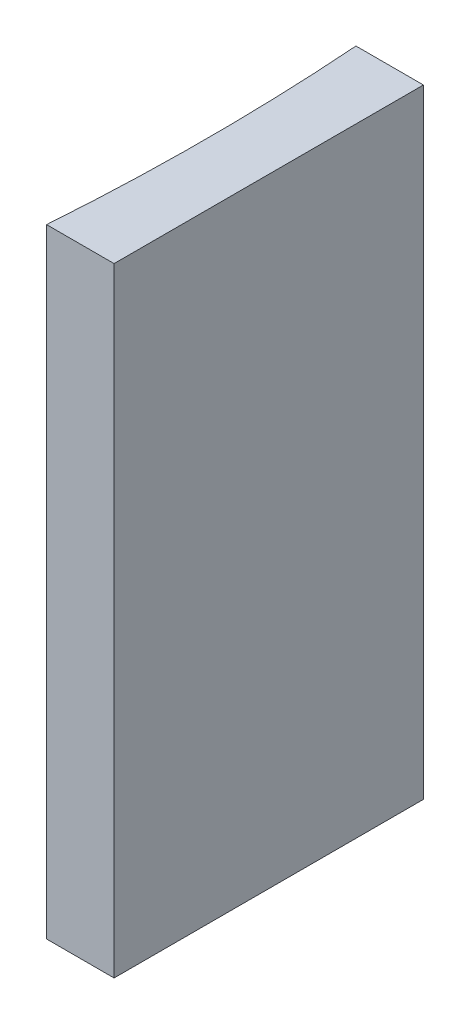
ISO-10303-21;
HEADER;
FILE_DESCRIPTION(('STEP AP214'),'2;1');
FILE_NAME('part.step','',(''),(''),'','','');
FILE_SCHEMA(('AUTOMOTIVE_DESIGN { 1 0 10303 214 1 1 1 1 }'));
ENDSEC;
DATA;
#1=APPLICATION_CONTEXT('core data for automotive mechanical design processes');
#2=APPLICATION_PROTOCOL_DEFINITION('international standard','automotive_design',2000,#1);
#3=PRODUCT_CONTEXT('',#1,'mechanical');
#4=PRODUCT('Part','Part','',(#3));
#5=PRODUCT_RELATED_PRODUCT_CATEGORY('part','',(#4));
#6=PRODUCT_DEFINITION_FORMATION('','',#4);
#7=PRODUCT_DEFINITION_CONTEXT('part definition',#1,'design');
#8=PRODUCT_DEFINITION('design','',#6,#7);
#9=PRODUCT_DEFINITION_SHAPE('','',#8);
#10=(LENGTH_UNIT() NAMED_UNIT(*) SI_UNIT(.MILLI.,.METRE.));
#11=(NAMED_UNIT(*) PLANE_ANGLE_UNIT() SI_UNIT($,.RADIAN.));
#12=(NAMED_UNIT(*) SI_UNIT($,.STERADIAN.) SOLID_ANGLE_UNIT());
#13=UNCERTAINTY_MEASURE_WITH_UNIT(LENGTH_MEASURE(1.E-05),#10,'distance_accuracy_value','');
#14=(GEOMETRIC_REPRESENTATION_CONTEXT(3) GLOBAL_UNCERTAINTY_ASSIGNED_CONTEXT((#13)) GLOBAL_UNIT_ASSIGNED_CONTEXT((#10,
#11,#12)) REPRESENTATION_CONTEXT('',''));
#15=CARTESIAN_POINT('',(0.,0.,0.));
#16=DIRECTION('',(0.,0.,1.));
#17=DIRECTION('',(1.,0.,0.));
#18=AXIS2_PLACEMENT_3D('',#15,#16,#17);
#19=CARTESIAN_POINT('',(0.,20.,0.));
#20=DIRECTION('',(0.,0.,1.));
#21=DIRECTION('',(1.,0.,0.));
#22=AXIS2_PLACEMENT_3D('',#19,#20,#21);
#23=PLANE('',#22);
#24=DIRECTION('',(-1.,0.,0.));
#25=VECTOR('',#24,1.);
#26=CARTESIAN_POINT('',(0.,0.,0.));
#27=LINE('',#26,#25);
#28=CARTESIAN_POINT('',(0.,0.,0.));
#29=VERTEX_POINT('',#28);
#30=CARTESIAN_POINT('',(-2.18197962040012,0.,0.));
#31=VERTEX_POINT('',#30);
#32=EDGE_CURVE('E98',#29,#31,#27,.T.);
#33=ORIENTED_EDGE('',*,*,#32,.T.);
#34=DIRECTION('',(0.,-1.,0.));
#35=VECTOR('',#34,1.);
#36=CARTESIAN_POINT('',(-2.18197962040012,20.,0.));
#37=LINE('',#36,#35);
#38=CARTESIAN_POINT('',(-2.18197962040012,20.,0.));
#39=VERTEX_POINT('',#38);
#40=EDGE_CURVE('E11',#39,#31,#37,.T.);
#41=ORIENTED_EDGE('',*,*,#40,.F.);
#42=DIRECTION('',(-1.,0.,0.));
#43=VECTOR('',#42,1.);
#44=CARTESIAN_POINT('',(0.,20.,0.));
#45=LINE('',#44,#43);
#46=CARTESIAN_POINT('',(0.,20.,0.));
#47=VERTEX_POINT('',#46);
#48=EDGE_CURVE('E86',#47,#39,#45,.T.);
#49=ORIENTED_EDGE('',*,*,#48,.F.);
#50=DIRECTION('',(0.,-1.,0.));
#51=VECTOR('',#50,1.);
#52=CARTESIAN_POINT('',(0.,20.,0.));
#53=LINE('',#52,#51);
#54=EDGE_CURVE('E94',#47,#29,#53,.T.);
#55=ORIENTED_EDGE('',*,*,#54,.T.);
#56=EDGE_LOOP('',(#33,#41,#49,#55));
#57=FACE_BOUND('',#56,.T.);
#58=ADVANCED_FACE('F35',(#57),#23,.F.);
#59=CARTESIAN_POINT('',(-70.78,20.,5.00000000000001));
#60=DIRECTION('',(0.,-1.,0.));
#61=DIRECTION('',(0.,0.,-1.));
#62=AXIS2_PLACEMENT_3D('',#59,#60,#61);
#63=CYLINDRICAL_SURFACE('',#62,68.78);
#64=CARTESIAN_POINT('',(-70.78,0.,5.00000000000001));
#65=DIRECTION('',(0.,-1.,0.));
#66=DIRECTION('',(0.,0.,1.));
#67=AXIS2_PLACEMENT_3D('',#64,#65,#66);
#68=CIRCLE('',#67,68.78);
#69=CARTESIAN_POINT('',(-2.18197962040012,0.,10.));
#70=VERTEX_POINT('',#69);
#71=EDGE_CURVE('E90',#31,#70,#68,.T.);
#72=ORIENTED_EDGE('',*,*,#71,.T.);
#73=DIRECTION('',(0.,-1.,0.));
#74=VECTOR('',#73,1.);
#75=CARTESIAN_POINT('',(-2.18197962040012,20.,10.));
#76=LINE('',#75,#74);
#77=CARTESIAN_POINT('',(-2.18197962040012,20.,10.));
#78=VERTEX_POINT('',#77);
#79=EDGE_CURVE('E43',#78,#70,#76,.T.);
#80=ORIENTED_EDGE('',*,*,#79,.F.);
#81=CARTESIAN_POINT('',(-70.78,20.,5.00000000000001));
#82=DIRECTION('',(0.,-1.,0.));
#83=DIRECTION('',(0.,0.,1.));
#84=AXIS2_PLACEMENT_3D('',#81,#82,#83);
#85=CIRCLE('',#84,68.78);
#86=EDGE_CURVE('E81',#39,#78,#85,.T.);
#87=ORIENTED_EDGE('',*,*,#86,.F.);
#88=ORIENTED_EDGE('',*,*,#40,.T.);
#89=EDGE_LOOP('',(#72,#80,#87,#88));
#90=FACE_BOUND('',#89,.T.);
#91=ADVANCED_FACE('F89',(#90),#63,.F.);
#92=CARTESIAN_POINT('',(0.,20.,10.));
#93=DIRECTION('',(0.,0.,-1.));
#94=DIRECTION('',(-1.,0.,0.));
#95=AXIS2_PLACEMENT_3D('',#92,#93,#94);
#96=PLANE('',#95);
#97=DIRECTION('',(1.,0.,0.));
#98=VECTOR('',#97,1.);
#99=CARTESIAN_POINT('',(0.,0.,10.));
#100=LINE('',#99,#98);
#101=CARTESIAN_POINT('',(0.,0.,10.));
#102=VERTEX_POINT('',#101);
#103=EDGE_CURVE('E68',#70,#102,#100,.T.);
#104=ORIENTED_EDGE('',*,*,#103,.T.);
#105=DIRECTION('',(0.,-1.,0.));
#106=VECTOR('',#105,1.);
#107=CARTESIAN_POINT('',(0.,20.,10.));
#108=LINE('',#107,#106);
#109=CARTESIAN_POINT('',(0.,20.,10.));
#110=VERTEX_POINT('',#109);
#111=EDGE_CURVE('E91',#110,#102,#108,.T.);
#112=ORIENTED_EDGE('',*,*,#111,.F.);
#113=DIRECTION('',(1.,0.,0.));
#114=VECTOR('',#113,1.);
#115=CARTESIAN_POINT('',(0.,20.,10.));
#116=LINE('',#115,#114);
#117=EDGE_CURVE('E84',#78,#110,#116,.T.);
#118=ORIENTED_EDGE('',*,*,#117,.F.);
#119=ORIENTED_EDGE('',*,*,#79,.T.);
#120=EDGE_LOOP('',(#104,#112,#118,#119));
#121=FACE_BOUND('',#120,.T.);
#122=ADVANCED_FACE('F92',(#121),#96,.F.);
#123=CARTESIAN_POINT('',(0.,20.,0.));
#124=DIRECTION('',(-1.,0.,0.));
#125=DIRECTION('',(0.,0.,1.));
#126=AXIS2_PLACEMENT_3D('',#123,#124,#125);
#127=PLANE('',#126);
#128=DIRECTION('',(0.,0.,-1.));
#129=VECTOR('',#128,1.);
#130=CARTESIAN_POINT('',(0.,0.,0.));
#131=LINE('',#130,#129);
#132=EDGE_CURVE('E74',#102,#29,#131,.T.);
#133=ORIENTED_EDGE('',*,*,#132,.T.);
#134=ORIENTED_EDGE('',*,*,#54,.F.);
#135=DIRECTION('',(0.,0.,-1.));
#136=VECTOR('',#135,1.);
#137=CARTESIAN_POINT('',(0.,20.,0.));
#138=LINE('',#137,#136);
#139=EDGE_CURVE('E51',#110,#47,#138,.T.);
#140=ORIENTED_EDGE('',*,*,#139,.F.);
#141=ORIENTED_EDGE('',*,*,#111,.T.);
#142=EDGE_LOOP('',(#133,#134,#140,#141));
#143=FACE_BOUND('',#142,.T.);
#144=ADVANCED_FACE('F105',(#143),#127,.F.);
#145=CARTESIAN_POINT('',(-70.78,20.,5.00000000000001));
#146=DIRECTION('',(0.,1.,0.));
#147=DIRECTION('',(0.,0.,1.));
#148=AXIS2_PLACEMENT_3D('',#145,#146,#147);
#149=PLANE('',#148);
#150=ORIENTED_EDGE('',*,*,#48,.T.);
#151=ORIENTED_EDGE('',*,*,#86,.T.);
#152=ORIENTED_EDGE('',*,*,#117,.T.);
#153=ORIENTED_EDGE('',*,*,#139,.T.);
#154=EDGE_LOOP('',(#150,#151,#152,#153));
#155=FACE_BOUND('',#154,.T.);
#156=ADVANCED_FACE('F82',(#155),#149,.T.);
#157=CARTESIAN_POINT('',(-70.78,0.,5.00000000000001));
#158=DIRECTION('',(0.,1.,0.));
#159=DIRECTION('',(0.,0.,1.));
#160=AXIS2_PLACEMENT_3D('',#157,#158,#159);
#161=PLANE('',#160);
#162=ORIENTED_EDGE('',*,*,#32,.F.);
#163=ORIENTED_EDGE('',*,*,#132,.F.);
#164=ORIENTED_EDGE('',*,*,#103,.F.);
#165=ORIENTED_EDGE('',*,*,#71,.F.);
#166=EDGE_LOOP('',(#162,#163,#164,#165));
#167=FACE_BOUND('',#166,.T.);
#168=ADVANCED_FACE('F108',(#167),#161,.F.);
#169=CLOSED_SHELL('',(#58,#91,#122,#144,#156,#168));
#170=MANIFOLD_SOLID_BREP('B2',#169);
#171=ADVANCED_BREP_SHAPE_REPRESENTATION('',(#18,#170),#14);
#172=SHAPE_DEFINITION_REPRESENTATION(#9,#171);
ENDSEC;
END-ISO-10303-21;
